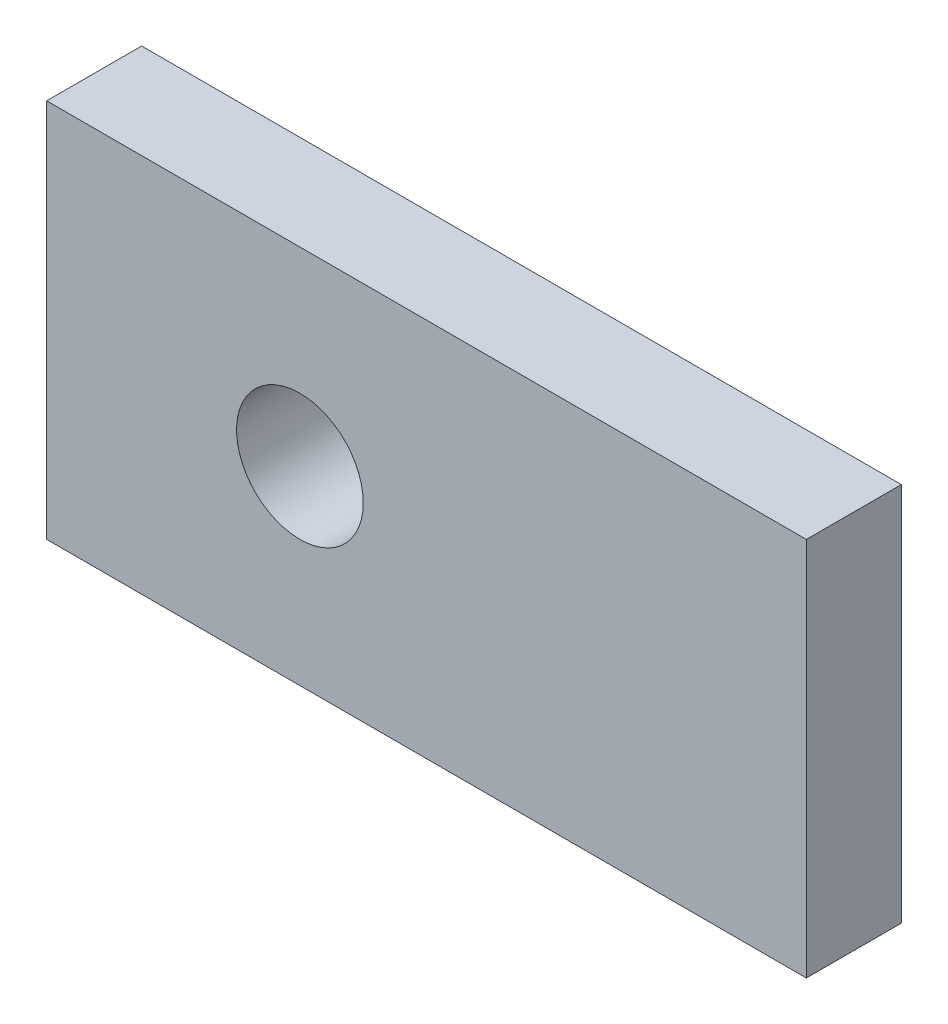
ISO-10303-21;
HEADER;
FILE_DESCRIPTION(('STEP AP214'),'2;1');
FILE_NAME('part.step','',(''),(''),'','','');
FILE_SCHEMA(('AUTOMOTIVE_DESIGN { 1 0 10303 214 1 1 1 1 }'));
ENDSEC;
DATA;
#1=APPLICATION_CONTEXT('core data for automotive mechanical design processes');
#2=APPLICATION_PROTOCOL_DEFINITION('international standard','automotive_design',2000,#1);
#3=PRODUCT_CONTEXT('',#1,'mechanical');
#4=PRODUCT('Part','Part','',(#3));
#5=PRODUCT_RELATED_PRODUCT_CATEGORY('part','',(#4));
#6=PRODUCT_DEFINITION_FORMATION('','',#4);
#7=PRODUCT_DEFINITION_CONTEXT('part definition',#1,'design');
#8=PRODUCT_DEFINITION('design','',#6,#7);
#9=PRODUCT_DEFINITION_SHAPE('','',#8);
#10=(LENGTH_UNIT() NAMED_UNIT(*) SI_UNIT(.MILLI.,.METRE.));
#11=(NAMED_UNIT(*) PLANE_ANGLE_UNIT() SI_UNIT($,.RADIAN.));
#12=(NAMED_UNIT(*) SI_UNIT($,.STERADIAN.) SOLID_ANGLE_UNIT());
#13=UNCERTAINTY_MEASURE_WITH_UNIT(LENGTH_MEASURE(1.E-05),#10,'distance_accuracy_value','');
#14=(GEOMETRIC_REPRESENTATION_CONTEXT(3) GLOBAL_UNCERTAINTY_ASSIGNED_CONTEXT((#13)) GLOBAL_UNIT_ASSIGNED_CONTEXT((#10,
#11,#12)) REPRESENTATION_CONTEXT('',''));
#15=CARTESIAN_POINT('',(0.,0.,0.));
#16=DIRECTION('',(0.,0.,1.));
#17=DIRECTION('',(1.,0.,0.));
#18=AXIS2_PLACEMENT_3D('',#15,#16,#17);
#19=CARTESIAN_POINT('',(60.,-30.,7.5));
#20=DIRECTION('',(0.,1.,0.));
#21=DIRECTION('',(0.,0.,1.));
#22=AXIS2_PLACEMENT_3D('',#19,#20,#21);
#23=PLANE('',#22);
#24=DIRECTION('',(0.,0.,-1.));
#25=VECTOR('',#24,1.);
#26=CARTESIAN_POINT('',(-60.,-30.,7.5));
#27=LINE('',#26,#25);
#28=CARTESIAN_POINT('',(-60.,-30.,7.5));
#29=VERTEX_POINT('',#28);
#30=CARTESIAN_POINT('',(-60.,-30.,-7.5));
#31=VERTEX_POINT('',#30);
#32=EDGE_CURVE('E121',#29,#31,#27,.T.);
#33=ORIENTED_EDGE('',*,*,#32,.T.);
#34=DIRECTION('',(-1.,0.,0.));
#35=VECTOR('',#34,1.);
#36=CARTESIAN_POINT('',(60.,-30.,-7.5));
#37=LINE('',#36,#35);
#38=CARTESIAN_POINT('',(60.,-30.,-7.5));
#39=VERTEX_POINT('',#38);
#40=EDGE_CURVE('E13',#39,#31,#37,.T.);
#41=ORIENTED_EDGE('',*,*,#40,.F.);
#42=DIRECTION('',(0.,0.,-1.));
#43=VECTOR('',#42,1.);
#44=CARTESIAN_POINT('',(60.,-30.,7.5));
#45=LINE('',#44,#43);
#46=CARTESIAN_POINT('',(60.,-30.,7.5));
#47=VERTEX_POINT('',#46);
#48=EDGE_CURVE('E107',#47,#39,#45,.T.);
#49=ORIENTED_EDGE('',*,*,#48,.F.);
#50=DIRECTION('',(-1.,0.,0.));
#51=VECTOR('',#50,1.);
#52=CARTESIAN_POINT('',(60.,-30.,7.5));
#53=LINE('',#52,#51);
#54=EDGE_CURVE('E116',#47,#29,#53,.T.);
#55=ORIENTED_EDGE('',*,*,#54,.T.);
#56=EDGE_LOOP('',(#33,#41,#49,#55));
#57=FACE_BOUND('',#56,.T.);
#58=ADVANCED_FACE('F56',(#57),#23,.F.);
#59=CARTESIAN_POINT('',(60.,-30.,-7.5));
#60=DIRECTION('',(0.,0.,1.));
#61=DIRECTION('',(1.,0.,0.));
#62=AXIS2_PLACEMENT_3D('',#59,#60,#61);
#63=PLANE('',#62);
#64=CARTESIAN_POINT('',(-20.,0.,-7.5));
#65=DIRECTION('',(0.,0.,1.));
#66=DIRECTION('',(1.,0.,0.));
#67=AXIS2_PLACEMENT_3D('',#64,#65,#66);
#68=CIRCLE('',#67,10.);
#69=CARTESIAN_POINT('',(-10.,0.,-7.5));
#70=VERTEX_POINT('',#69);
#71=EDGE_CURVE('E141',#70,#70,#68,.T.);
#72=ORIENTED_EDGE('',*,*,#71,.T.);
#73=EDGE_LOOP('',(#72));
#74=FACE_BOUND('',#73,.T.);
#75=DIRECTION('',(0.,1.,0.));
#76=VECTOR('',#75,1.);
#77=CARTESIAN_POINT('',(-60.,-30.,-7.5));
#78=LINE('',#77,#76);
#79=CARTESIAN_POINT('',(-60.,30.,-7.5));
#80=VERTEX_POINT('',#79);
#81=EDGE_CURVE('E111',#31,#80,#78,.T.);
#82=ORIENTED_EDGE('',*,*,#81,.T.);
#83=DIRECTION('',(-1.,0.,0.));
#84=VECTOR('',#83,1.);
#85=CARTESIAN_POINT('',(60.,30.,-7.5));
#86=LINE('',#85,#84);
#87=CARTESIAN_POINT('',(60.,30.,-7.5));
#88=VERTEX_POINT('',#87);
#89=EDGE_CURVE('E64',#88,#80,#86,.T.);
#90=ORIENTED_EDGE('',*,*,#89,.F.);
#91=DIRECTION('',(0.,1.,0.));
#92=VECTOR('',#91,1.);
#93=CARTESIAN_POINT('',(60.,-30.,-7.5));
#94=LINE('',#93,#92);
#95=EDGE_CURVE('E102',#39,#88,#94,.T.);
#96=ORIENTED_EDGE('',*,*,#95,.F.);
#97=ORIENTED_EDGE('',*,*,#40,.T.);
#98=EDGE_LOOP('',(#82,#90,#96,#97));
#99=FACE_BOUND('',#98,.T.);
#100=ADVANCED_FACE('F110',(#74,#99),#63,.F.);
#101=CARTESIAN_POINT('',(60.,30.,7.5));
#102=DIRECTION('',(0.,-1.,0.));
#103=DIRECTION('',(0.,0.,-1.));
#104=AXIS2_PLACEMENT_3D('',#101,#102,#103);
#105=PLANE('',#104);
#106=DIRECTION('',(0.,0.,1.));
#107=VECTOR('',#106,1.);
#108=CARTESIAN_POINT('',(-60.,30.,7.5));
#109=LINE('',#108,#107);
#110=CARTESIAN_POINT('',(-60.,30.,7.5));
#111=VERTEX_POINT('',#110);
#112=EDGE_CURVE('E89',#80,#111,#109,.T.);
#113=ORIENTED_EDGE('',*,*,#112,.T.);
#114=DIRECTION('',(-1.,0.,0.));
#115=VECTOR('',#114,1.);
#116=CARTESIAN_POINT('',(60.,30.,7.5));
#117=LINE('',#116,#115);
#118=CARTESIAN_POINT('',(60.,30.,7.5));
#119=VERTEX_POINT('',#118);
#120=EDGE_CURVE('E112',#119,#111,#117,.T.);
#121=ORIENTED_EDGE('',*,*,#120,.F.);
#122=DIRECTION('',(0.,0.,1.));
#123=VECTOR('',#122,1.);
#124=CARTESIAN_POINT('',(60.,30.,7.5));
#125=LINE('',#124,#123);
#126=EDGE_CURVE('E105',#88,#119,#125,.T.);
#127=ORIENTED_EDGE('',*,*,#126,.F.);
#128=ORIENTED_EDGE('',*,*,#89,.T.);
#129=EDGE_LOOP('',(#113,#121,#127,#128));
#130=FACE_BOUND('',#129,.T.);
#131=ADVANCED_FACE('F113',(#130),#105,.F.);
#132=CARTESIAN_POINT('',(60.,-30.,7.5));
#133=DIRECTION('',(0.,0.,-1.));
#134=DIRECTION('',(-1.,0.,0.));
#135=AXIS2_PLACEMENT_3D('',#132,#133,#134);
#136=PLANE('',#135);
#137=CARTESIAN_POINT('',(-20.,0.,7.5));
#138=DIRECTION('',(0.,0.,1.));
#139=DIRECTION('',(1.,0.,0.));
#140=AXIS2_PLACEMENT_3D('',#137,#138,#139);
#141=CIRCLE('',#140,10.);
#142=CARTESIAN_POINT('',(-10.,0.,7.5));
#143=VERTEX_POINT('',#142);
#144=EDGE_CURVE('E144',#143,#143,#141,.T.);
#145=ORIENTED_EDGE('',*,*,#144,.F.);
#146=EDGE_LOOP('',(#145));
#147=FACE_BOUND('',#146,.T.);
#148=DIRECTION('',(0.,-1.,0.));
#149=VECTOR('',#148,1.);
#150=CARTESIAN_POINT('',(-60.,-30.,7.5));
#151=LINE('',#150,#149);
#152=EDGE_CURVE('E95',#111,#29,#151,.T.);
#153=ORIENTED_EDGE('',*,*,#152,.T.);
#154=ORIENTED_EDGE('',*,*,#54,.F.);
#155=DIRECTION('',(0.,-1.,0.));
#156=VECTOR('',#155,1.);
#157=CARTESIAN_POINT('',(60.,-30.,7.5));
#158=LINE('',#157,#156);
#159=EDGE_CURVE('E72',#119,#47,#158,.T.);
#160=ORIENTED_EDGE('',*,*,#159,.F.);
#161=ORIENTED_EDGE('',*,*,#120,.T.);
#162=EDGE_LOOP('',(#153,#154,#160,#161));
#163=FACE_BOUND('',#162,.T.);
#164=ADVANCED_FACE('F134',(#147,#163),#136,.F.);
#165=CARTESIAN_POINT('',(60.,-30.,-7.5));
#166=DIRECTION('',(1.,0.,0.));
#167=DIRECTION('',(0.,0.,-1.));
#168=AXIS2_PLACEMENT_3D('',#165,#166,#167);
#169=PLANE('',#168);
#170=ORIENTED_EDGE('',*,*,#48,.T.);
#171=ORIENTED_EDGE('',*,*,#95,.T.);
#172=ORIENTED_EDGE('',*,*,#126,.T.);
#173=ORIENTED_EDGE('',*,*,#159,.T.);
#174=EDGE_LOOP('',(#170,#171,#172,#173));
#175=FACE_BOUND('',#174,.T.);
#176=ADVANCED_FACE('F103',(#175),#169,.T.);
#177=CARTESIAN_POINT('',(-60.,-30.,-7.5));
#178=DIRECTION('',(1.,0.,0.));
#179=DIRECTION('',(0.,0.,-1.));
#180=AXIS2_PLACEMENT_3D('',#177,#178,#179);
#181=PLANE('',#180);
#182=ORIENTED_EDGE('',*,*,#32,.F.);
#183=ORIENTED_EDGE('',*,*,#152,.F.);
#184=ORIENTED_EDGE('',*,*,#112,.F.);
#185=ORIENTED_EDGE('',*,*,#81,.F.);
#186=EDGE_LOOP('',(#182,#183,#184,#185));
#187=FACE_BOUND('',#186,.T.);
#188=ADVANCED_FACE('F137',(#187),#181,.F.);
#189=CARTESIAN_POINT('',(-20.,0.,-12.5));
#190=DIRECTION('',(0.,0.,1.));
#191=DIRECTION('',(1.,0.,0.));
#192=AXIS2_PLACEMENT_3D('',#189,#190,#191);
#193=CYLINDRICAL_SURFACE('',#192,10.);
#194=ORIENTED_EDGE('',*,*,#144,.T.);
#195=EDGE_LOOP('',(#194));
#196=FACE_BOUND('',#195,.T.);
#197=ORIENTED_EDGE('',*,*,#71,.F.);
#198=EDGE_LOOP('',(#197));
#199=FACE_BOUND('',#198,.T.);
#200=ADVANCED_FACE('F153',(#196,#199),#193,.F.);
#201=CLOSED_SHELL('',(#58,#100,#131,#164,#176,#188,#200));
#202=MANIFOLD_SOLID_BREP('B2',#201);
#203=ADVANCED_BREP_SHAPE_REPRESENTATION('',(#18,#202),#14);
#204=SHAPE_DEFINITION_REPRESENTATION(#9,#203);
ENDSEC;
END-ISO-10303-21;
